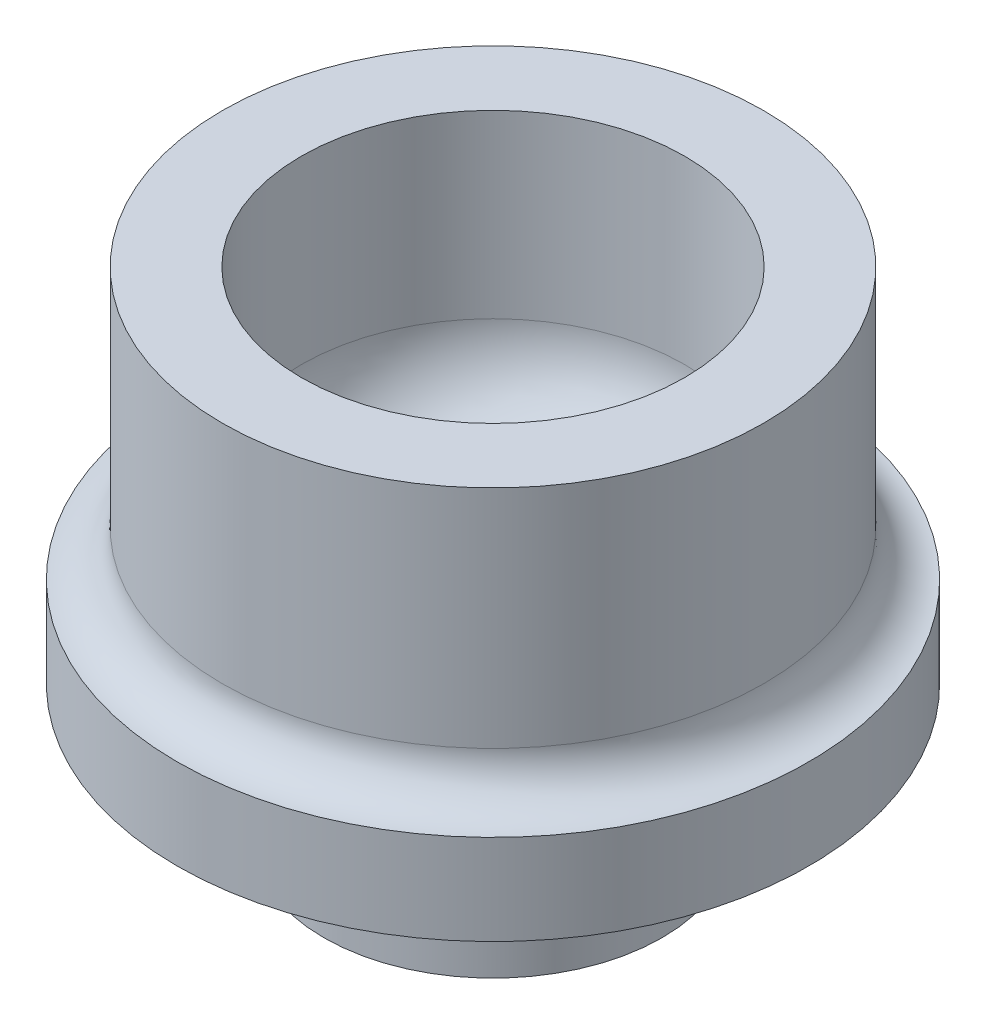
ISO-10303-21;
HEADER;
FILE_DESCRIPTION(('STEP AP214'),'2;1');
FILE_NAME('part.step','',(''),(''),'','','');
FILE_SCHEMA(('AUTOMOTIVE_DESIGN { 1 0 10303 214 1 1 1 1 }'));
ENDSEC;
DATA;
#1=APPLICATION_CONTEXT('core data for automotive mechanical design processes');
#2=APPLICATION_PROTOCOL_DEFINITION('international standard','automotive_design',2000,#1);
#3=PRODUCT_CONTEXT('',#1,'mechanical');
#4=PRODUCT('Part','Part','',(#3));
#5=PRODUCT_RELATED_PRODUCT_CATEGORY('part','',(#4));
#6=PRODUCT_DEFINITION_FORMATION('','',#4);
#7=PRODUCT_DEFINITION_CONTEXT('part definition',#1,'design');
#8=PRODUCT_DEFINITION('design','',#6,#7);
#9=PRODUCT_DEFINITION_SHAPE('','',#8);
#10=(LENGTH_UNIT() NAMED_UNIT(*) SI_UNIT(.MILLI.,.METRE.));
#11=(NAMED_UNIT(*) PLANE_ANGLE_UNIT() SI_UNIT($,.RADIAN.));
#12=(NAMED_UNIT(*) SI_UNIT($,.STERADIAN.) SOLID_ANGLE_UNIT());
#13=UNCERTAINTY_MEASURE_WITH_UNIT(LENGTH_MEASURE(1.E-05),#10,'distance_accuracy_value','');
#14=(GEOMETRIC_REPRESENTATION_CONTEXT(3) GLOBAL_UNCERTAINTY_ASSIGNED_CONTEXT((#13)) GLOBAL_UNIT_ASSIGNED_CONTEXT((#10,
#11,#12)) REPRESENTATION_CONTEXT('',''));
#15=CARTESIAN_POINT('',(0.,0.,0.));
#16=DIRECTION('',(0.,0.,1.));
#17=DIRECTION('',(1.,0.,0.));
#18=AXIS2_PLACEMENT_3D('',#15,#16,#17);
#19=CARTESIAN_POINT('',(0.,0.,0.));
#20=DIRECTION('',(0.,1.,0.));
#21=DIRECTION('',(0.,0.,1.));
#22=AXIS2_PLACEMENT_3D('',#19,#20,#21);
#23=PLANE('',#22);
#24=CARTESIAN_POINT('',(0.,0.,0.));
#25=DIRECTION('',(0.,1.,0.));
#26=DIRECTION('',(0.,0.,1.));
#27=AXIS2_PLACEMENT_3D('',#24,#25,#26);
#28=CIRCLE('',#27,7.);
#29=CARTESIAN_POINT('',(0.,0.,7.));
#30=VERTEX_POINT('',#29);
#31=EDGE_CURVE('E53',#30,#30,#28,.T.);
#32=ORIENTED_EDGE('',*,*,#31,.F.);
#33=EDGE_LOOP('',(#32));
#34=FACE_BOUND('',#33,.T.);
#35=CARTESIAN_POINT('',(0.,0.,0.));
#36=DIRECTION('',(0.,1.,0.));
#37=DIRECTION('',(0.,0.,1.));
#38=AXIS2_PLACEMENT_3D('',#35,#36,#37);
#39=CIRCLE('',#38,3.75);
#40=CARTESIAN_POINT('',(0.,0.,3.75));
#41=VERTEX_POINT('',#40);
#42=EDGE_CURVE('E10',#41,#41,#39,.F.);
#43=ORIENTED_EDGE('',*,*,#42,.F.);
#44=EDGE_LOOP('',(#43));
#45=FACE_BOUND('',#44,.T.);
#46=ADVANCED_FACE('F32',(#34,#45),#23,.F.);
#47=CARTESIAN_POINT('',(0.,2.,0.));
#48=DIRECTION('',(0.,-1.,0.));
#49=DIRECTION('',(0.,0.,-1.));
#50=AXIS2_PLACEMENT_3D('',#47,#48,#49);
#51=CYLINDRICAL_SURFACE('',#50,7.);
#52=CARTESIAN_POINT('',(0.,2.,0.));
#53=DIRECTION('',(0.,1.,0.));
#54=DIRECTION('',(0.,0.,1.));
#55=AXIS2_PLACEMENT_3D('',#52,#53,#54);
#56=CIRCLE('',#55,7.);
#57=CARTESIAN_POINT('',(0.,2.,7.));
#58=VERTEX_POINT('',#57);
#59=EDGE_CURVE('E52',#58,#58,#56,.T.);
#60=ORIENTED_EDGE('',*,*,#59,.F.);
#61=EDGE_LOOP('',(#60));
#62=FACE_BOUND('',#61,.T.);
#63=ORIENTED_EDGE('',*,*,#31,.T.);
#64=EDGE_LOOP('',(#63));
#65=FACE_BOUND('',#64,.T.);
#66=ADVANCED_FACE('F92',(#62,#65),#51,.T.);
#67=CARTESIAN_POINT('',(0.,8.,0.));
#68=DIRECTION('',(0.,1.,0.));
#69=DIRECTION('',(0.,0.,1.));
#70=AXIS2_PLACEMENT_3D('',#67,#68,#69);
#71=PLANE('',#70);
#72=CARTESIAN_POINT('',(0.,8.,0.));
#73=DIRECTION('',(0.,1.,0.));
#74=DIRECTION('',(0.,0.,1.));
#75=AXIS2_PLACEMENT_3D('',#72,#73,#74);
#76=CIRCLE('',#75,6.);
#77=CARTESIAN_POINT('',(0.,8.,6.));
#78=VERTEX_POINT('',#77);
#79=EDGE_CURVE('E56',#78,#78,#76,.T.);
#80=ORIENTED_EDGE('',*,*,#79,.T.);
#81=EDGE_LOOP('',(#80));
#82=FACE_BOUND('',#81,.T.);
#83=CARTESIAN_POINT('',(0.,8.,0.));
#84=DIRECTION('',(0.,1.,0.));
#85=DIRECTION('',(0.,0.,1.));
#86=AXIS2_PLACEMENT_3D('',#83,#84,#85);
#87=CIRCLE('',#86,4.25);
#88=CARTESIAN_POINT('',(0.,8.,4.25));
#89=VERTEX_POINT('',#88);
#90=EDGE_CURVE('E61',#89,#89,#87,.T.);
#91=ORIENTED_EDGE('',*,*,#90,.F.);
#92=EDGE_LOOP('',(#91));
#93=FACE_BOUND('',#92,.T.);
#94=ADVANCED_FACE('F99',(#82,#93),#71,.T.);
#95=CARTESIAN_POINT('',(0.,8.,0.));
#96=DIRECTION('',(0.,-1.,0.));
#97=DIRECTION('',(0.,0.,-1.));
#98=AXIS2_PLACEMENT_3D('',#95,#96,#97);
#99=CYLINDRICAL_SURFACE('',#98,6.);
#100=CARTESIAN_POINT('',(0.,3.,0.));
#101=DIRECTION('',(0.,1.,0.));
#102=DIRECTION('',(0.,0.,1.));
#103=AXIS2_PLACEMENT_3D('',#100,#101,#102);
#104=CIRCLE('',#103,6.);
#105=CARTESIAN_POINT('',(0.,3.,6.));
#106=VERTEX_POINT('',#105);
#107=EDGE_CURVE('E39',#106,#106,#104,.T.);
#108=ORIENTED_EDGE('',*,*,#107,.T.);
#109=EDGE_LOOP('',(#108));
#110=FACE_BOUND('',#109,.T.);
#111=ORIENTED_EDGE('',*,*,#79,.F.);
#112=EDGE_LOOP('',(#111));
#113=FACE_BOUND('',#112,.T.);
#114=ADVANCED_FACE('F138',(#110,#113),#99,.T.);
#115=CARTESIAN_POINT('',(0.,8.,0.));
#116=DIRECTION('',(0.,-1.,0.));
#117=DIRECTION('',(0.,0.,-1.));
#118=AXIS2_PLACEMENT_3D('',#115,#116,#117);
#119=CYLINDRICAL_SURFACE('',#118,4.25);
#120=CARTESIAN_POINT('',(0.,4.,0.));
#121=DIRECTION('',(0.,1.,0.));
#122=DIRECTION('',(0.,0.,1.));
#123=AXIS2_PLACEMENT_3D('',#120,#121,#122);
#124=CIRCLE('',#123,4.25);
#125=CARTESIAN_POINT('',(0.,4.,4.25));
#126=VERTEX_POINT('',#125);
#127=EDGE_CURVE('E47',#126,#126,#124,.F.);
#128=ORIENTED_EDGE('',*,*,#127,.T.);
#129=EDGE_LOOP('',(#128));
#130=FACE_BOUND('',#129,.T.);
#131=ORIENTED_EDGE('',*,*,#90,.T.);
#132=EDGE_LOOP('',(#131));
#133=FACE_BOUND('',#132,.T.);
#134=ADVANCED_FACE('F143',(#130,#133),#119,.F.);
#135=CARTESIAN_POINT('',(0.,2.,0.));
#136=DIRECTION('',(0.,1.,0.));
#137=DIRECTION('',(0.,0.,1.));
#138=AXIS2_PLACEMENT_3D('',#135,#136,#137);
#139=PLANE('',#138);
#140=CARTESIAN_POINT('',(0.,2.,0.));
#141=DIRECTION('',(0.,1.,0.));
#142=DIRECTION('',(0.,0.,1.));
#143=AXIS2_PLACEMENT_3D('',#140,#141,#142);
#144=CIRCLE('',#143,2.25);
#145=CARTESIAN_POINT('',(0.,2.,2.25));
#146=VERTEX_POINT('',#145);
#147=EDGE_CURVE('E43',#146,#146,#144,.T.);
#148=ORIENTED_EDGE('',*,*,#147,.T.);
#149=EDGE_LOOP('',(#148));
#150=FACE_BOUND('',#149,.T.);
#151=ADVANCED_FACE('F154',(#150),#139,.T.);
#152=CARTESIAN_POINT('',(0.,4.,0.));
#153=DIRECTION('',(0.,1.,0.));
#154=DIRECTION('',(0.,0.,1.));
#155=AXIS2_PLACEMENT_3D('',#152,#153,#154);
#156=TOROIDAL_SURFACE('',#155,2.25,2.);
#157=ORIENTED_EDGE('',*,*,#147,.F.);
#158=EDGE_LOOP('',(#157));
#159=FACE_BOUND('',#158,.T.);
#160=ORIENTED_EDGE('',*,*,#127,.F.);
#161=EDGE_LOOP('',(#160));
#162=FACE_BOUND('',#161,.T.);
#163=ADVANCED_FACE('F88',(#159,#162),#156,.F.);
#164=CARTESIAN_POINT('',(0.,3.,0.));
#165=DIRECTION('',(0.,1.,0.));
#166=DIRECTION('',(0.,0.,1.));
#167=AXIS2_PLACEMENT_3D('',#164,#165,#166);
#168=TOROIDAL_SURFACE('',#167,7.,1.);
#169=ORIENTED_EDGE('',*,*,#59,.T.);
#170=EDGE_LOOP('',(#169));
#171=FACE_BOUND('',#170,.T.);
#172=ORIENTED_EDGE('',*,*,#107,.F.);
#173=EDGE_LOOP('',(#172));
#174=FACE_BOUND('',#173,.T.);
#175=ADVANCED_FACE('F34',(#171,#174),#168,.F.);
#176=CARTESIAN_POINT('',(0.,-3.,0.));
#177=DIRECTION('',(0.,-1.,0.));
#178=DIRECTION('',(0.,0.,-1.));
#179=AXIS2_PLACEMENT_3D('',#176,#177,#178);
#180=PLANE('',#179);
#181=CARTESIAN_POINT('',(0.,-3.,0.));
#182=DIRECTION('',(0.,-1.,0.));
#183=DIRECTION('',(0.,0.,-1.));
#184=AXIS2_PLACEMENT_3D('',#181,#182,#183);
#185=CIRCLE('',#184,3.75);
#186=CARTESIAN_POINT('',(0.,-3.,-3.75));
#187=VERTEX_POINT('',#186);
#188=EDGE_CURVE('E64',#187,#187,#185,.T.);
#189=ORIENTED_EDGE('',*,*,#188,.T.);
#190=EDGE_LOOP('',(#189));
#191=FACE_BOUND('',#190,.T.);
#192=CARTESIAN_POINT('',(0.,-3.,0.));
#193=DIRECTION('',(0.,-1.,0.));
#194=DIRECTION('',(0.,0.,-1.));
#195=AXIS2_PLACEMENT_3D('',#192,#193,#194);
#196=CIRCLE('',#195,3.25);
#197=CARTESIAN_POINT('',(0.,-3.,-3.25));
#198=VERTEX_POINT('',#197);
#199=EDGE_CURVE('E67',#198,#198,#196,.T.);
#200=ORIENTED_EDGE('',*,*,#199,.F.);
#201=EDGE_LOOP('',(#200));
#202=FACE_BOUND('',#201,.T.);
#203=ADVANCED_FACE('F77',(#191,#202),#180,.T.);
#204=CARTESIAN_POINT('',(0.,-3.,0.));
#205=DIRECTION('',(0.,1.,0.));
#206=DIRECTION('',(0.,0.,1.));
#207=AXIS2_PLACEMENT_3D('',#204,#205,#206);
#208=CYLINDRICAL_SURFACE('',#207,3.75);
#209=ORIENTED_EDGE('',*,*,#188,.F.);
#210=EDGE_LOOP('',(#209));
#211=FACE_BOUND('',#210,.T.);
#212=ORIENTED_EDGE('',*,*,#42,.T.);
#213=EDGE_LOOP('',(#212));
#214=FACE_BOUND('',#213,.T.);
#215=ADVANCED_FACE('F79',(#211,#214),#208,.T.);
#216=CARTESIAN_POINT('',(0.,-3.,0.));
#217=DIRECTION('',(0.,1.,0.));
#218=DIRECTION('',(0.,0.,1.));
#219=AXIS2_PLACEMENT_3D('',#216,#217,#218);
#220=CYLINDRICAL_SURFACE('',#219,3.25);
#221=ORIENTED_EDGE('',*,*,#199,.T.);
#222=EDGE_LOOP('',(#221));
#223=FACE_BOUND('',#222,.T.);
#224=CARTESIAN_POINT('',(0.,0.,0.));
#225=DIRECTION('',(0.,-1.,0.));
#226=DIRECTION('',(0.,0.,-1.));
#227=AXIS2_PLACEMENT_3D('',#224,#225,#226);
#228=CIRCLE('',#227,3.25);
#229=CARTESIAN_POINT('',(0.,0.,-3.25));
#230=VERTEX_POINT('',#229);
#231=EDGE_CURVE('E68',#230,#230,#228,.T.);
#232=ORIENTED_EDGE('',*,*,#231,.F.);
#233=EDGE_LOOP('',(#232));
#234=FACE_BOUND('',#233,.T.);
#235=ADVANCED_FACE('F74',(#223,#234),#220,.F.);
#236=ORIENTED_EDGE('',*,*,#231,.T.);
#237=EDGE_LOOP('',(#236));
#238=FACE_BOUND('',#237,.T.);
#239=ADVANCED_FACE('F95',(#238),#23,.F.);
#240=CLOSED_SHELL('',(#46,#66,#94,#114,#134,#151,#163,#175,#203,#215,#235,#239));
#241=MANIFOLD_SOLID_BREP('B2',#240);
#242=ADVANCED_BREP_SHAPE_REPRESENTATION('',(#18,#241),#14);
#243=SHAPE_DEFINITION_REPRESENTATION(#9,#242);
ENDSEC;
END-ISO-10303-21;
